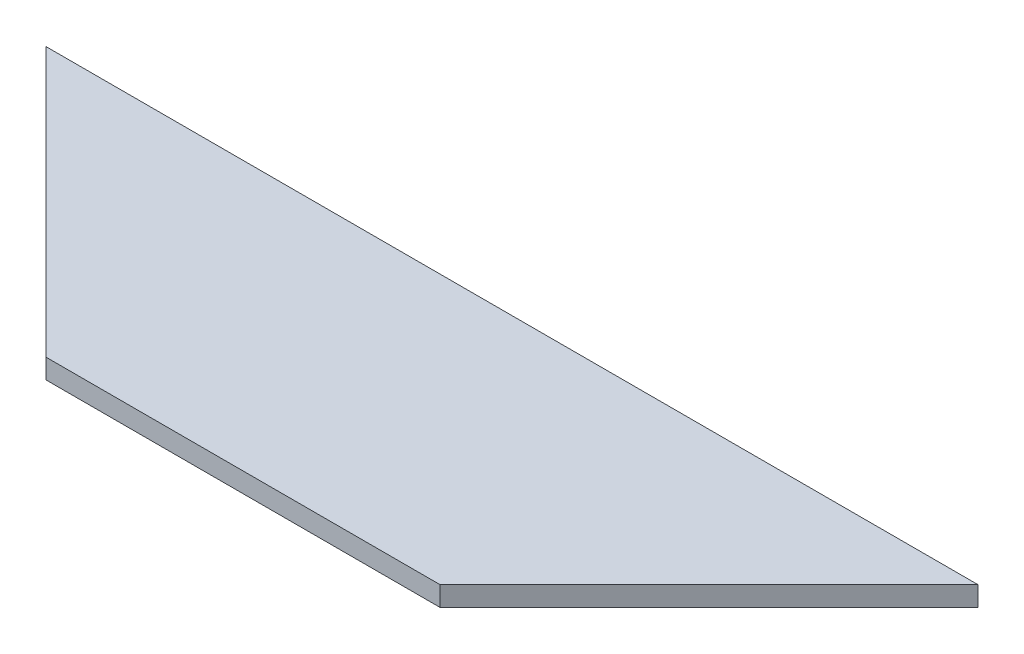
ISO-10303-21;
HEADER;
FILE_DESCRIPTION(('STEP AP214'),'2;1');
FILE_NAME('part.step','',(''),(''),'','','');
FILE_SCHEMA(('AUTOMOTIVE_DESIGN { 1 0 10303 214 1 1 1 1 }'));
ENDSEC;
DATA;
#1=APPLICATION_CONTEXT('core data for automotive mechanical design processes');
#2=APPLICATION_PROTOCOL_DEFINITION('international standard','automotive_design',2000,#1);
#3=PRODUCT_CONTEXT('',#1,'mechanical');
#4=PRODUCT('Part','Part','',(#3));
#5=PRODUCT_RELATED_PRODUCT_CATEGORY('part','',(#4));
#6=PRODUCT_DEFINITION_FORMATION('','',#4);
#7=PRODUCT_DEFINITION_CONTEXT('part definition',#1,'design');
#8=PRODUCT_DEFINITION('design','',#6,#7);
#9=PRODUCT_DEFINITION_SHAPE('','',#8);
#10=(LENGTH_UNIT() NAMED_UNIT(*) SI_UNIT(.MILLI.,.METRE.));
#11=(NAMED_UNIT(*) PLANE_ANGLE_UNIT() SI_UNIT($,.RADIAN.));
#12=(NAMED_UNIT(*) SI_UNIT($,.STERADIAN.) SOLID_ANGLE_UNIT());
#13=UNCERTAINTY_MEASURE_WITH_UNIT(LENGTH_MEASURE(1.E-05),#10,'distance_accuracy_value','');
#14=(GEOMETRIC_REPRESENTATION_CONTEXT(3) GLOBAL_UNCERTAINTY_ASSIGNED_CONTEXT((#13)) GLOBAL_UNIT_ASSIGNED_CONTEXT((#10,
#11,#12)) REPRESENTATION_CONTEXT('',''));
#15=CARTESIAN_POINT('',(0.,0.,0.));
#16=DIRECTION('',(0.,0.,1.));
#17=DIRECTION('',(1.,0.,0.));
#18=AXIS2_PLACEMENT_3D('',#15,#16,#17);
#19=CARTESIAN_POINT('',(259.737032749589,19.05,259.737032749575));
#20=DIRECTION('',(0.707106781186528,0.,-0.707106781186567));
#21=DIRECTION('',(-0.707106781186567,0.,-0.707106781186528));
#22=AXIS2_PLACEMENT_3D('',#19,#20,#21);
#23=PLANE('',#22);
#24=DIRECTION('',(0.707106781186567,0.,0.707106781186528));
#25=VECTOR('',#24,1.);
#26=CARTESIAN_POINT('',(259.737032749589,0.,259.737032749575));
#27=LINE('',#26,#25);
#28=CARTESIAN_POINT('',(0.,0.,0.));
#29=VERTEX_POINT('',#28);
#30=CARTESIAN_POINT('',(259.737032749589,0.,259.737032749575));
#31=VERTEX_POINT('',#30);
#32=EDGE_CURVE('E102',#29,#31,#27,.T.);
#33=ORIENTED_EDGE('',*,*,#32,.T.);
#34=DIRECTION('',(0.,-1.,0.));
#35=VECTOR('',#34,1.);
#36=CARTESIAN_POINT('',(259.737032749589,19.05,259.737032749575));
#37=LINE('',#36,#35);
#38=CARTESIAN_POINT('',(259.737032749589,19.05,259.737032749575));
#39=VERTEX_POINT('',#38);
#40=EDGE_CURVE('E11',#39,#31,#37,.T.);
#41=ORIENTED_EDGE('',*,*,#40,.F.);
#42=DIRECTION('',(0.707106781186567,0.,0.707106781186528));
#43=VECTOR('',#42,1.);
#44=CARTESIAN_POINT('',(259.737032749589,19.05,259.737032749575));
#45=LINE('',#44,#43);
#46=CARTESIAN_POINT('',(0.,19.05,0.));
#47=VERTEX_POINT('',#46);
#48=EDGE_CURVE('E90',#47,#39,#45,.T.);
#49=ORIENTED_EDGE('',*,*,#48,.F.);
#50=DIRECTION('',(0.,-1.,0.));
#51=VECTOR('',#50,1.);
#52=CARTESIAN_POINT('',(0.,19.05,0.));
#53=LINE('',#52,#51);
#54=EDGE_CURVE('E98',#47,#29,#53,.T.);
#55=ORIENTED_EDGE('',*,*,#54,.T.);
#56=EDGE_LOOP('',(#33,#41,#49,#55));
#57=FACE_BOUND('',#56,.T.);
#58=ADVANCED_FACE('F39',(#57),#23,.F.);
#59=CARTESIAN_POINT('',(640.262967250417,19.05,259.737032749581));
#60=DIRECTION('',(0.,0.,-1.));
#61=DIRECTION('',(-1.,0.,0.));
#62=AXIS2_PLACEMENT_3D('',#59,#60,#61);
#63=PLANE('',#62);
#64=DIRECTION('',(1.,0.,0.));
#65=VECTOR('',#64,1.);
#66=CARTESIAN_POINT('',(640.262967250417,0.,259.737032749581));
#67=LINE('',#66,#65);
#68=CARTESIAN_POINT('',(640.262967250417,0.,259.737032749581));
#69=VERTEX_POINT('',#68);
#70=EDGE_CURVE('E94',#31,#69,#67,.T.);
#71=ORIENTED_EDGE('',*,*,#70,.T.);
#72=DIRECTION('',(0.,-1.,0.));
#73=VECTOR('',#72,1.);
#74=CARTESIAN_POINT('',(640.262967250417,19.05,259.737032749581));
#75=LINE('',#74,#73);
#76=CARTESIAN_POINT('',(640.262967250417,19.05,259.737032749581));
#77=VERTEX_POINT('',#76);
#78=EDGE_CURVE('E47',#77,#69,#75,.T.);
#79=ORIENTED_EDGE('',*,*,#78,.F.);
#80=DIRECTION('',(1.,0.,0.));
#81=VECTOR('',#80,1.);
#82=CARTESIAN_POINT('',(640.262967250417,19.05,259.737032749581));
#83=LINE('',#82,#81);
#84=EDGE_CURVE('E85',#39,#77,#83,.T.);
#85=ORIENTED_EDGE('',*,*,#84,.F.);
#86=ORIENTED_EDGE('',*,*,#40,.T.);
#87=EDGE_LOOP('',(#71,#79,#85,#86));
#88=FACE_BOUND('',#87,.T.);
#89=ADVANCED_FACE('F93',(#88),#63,.F.);
#90=CARTESIAN_POINT('',(900.,19.05,0.));
#91=DIRECTION('',(-0.707106781186544,0.,-0.707106781186551));
#92=DIRECTION('',(-0.707106781186551,0.,0.707106781186544));
#93=AXIS2_PLACEMENT_3D('',#90,#91,#92);
#94=PLANE('',#93);
#95=DIRECTION('',(0.707106781186551,0.,-0.707106781186544));
#96=VECTOR('',#95,1.);
#97=CARTESIAN_POINT('',(900.,0.,0.));
#98=LINE('',#97,#96);
#99=CARTESIAN_POINT('',(900.,0.,0.));
#100=VERTEX_POINT('',#99);
#101=EDGE_CURVE('E72',#69,#100,#98,.T.);
#102=ORIENTED_EDGE('',*,*,#101,.T.);
#103=DIRECTION('',(0.,-1.,0.));
#104=VECTOR('',#103,1.);
#105=CARTESIAN_POINT('',(900.,19.05,0.));
#106=LINE('',#105,#104);
#107=CARTESIAN_POINT('',(900.,19.05,0.));
#108=VERTEX_POINT('',#107);
#109=EDGE_CURVE('E95',#108,#100,#106,.T.);
#110=ORIENTED_EDGE('',*,*,#109,.F.);
#111=DIRECTION('',(0.707106781186551,0.,-0.707106781186544));
#112=VECTOR('',#111,1.);
#113=CARTESIAN_POINT('',(900.,19.05,0.));
#114=LINE('',#113,#112);
#115=EDGE_CURVE('E88',#77,#108,#114,.T.);
#116=ORIENTED_EDGE('',*,*,#115,.F.);
#117=ORIENTED_EDGE('',*,*,#78,.T.);
#118=EDGE_LOOP('',(#102,#110,#116,#117));
#119=FACE_BOUND('',#118,.T.);
#120=ADVANCED_FACE('F96',(#119),#94,.F.);
#121=CARTESIAN_POINT('',(0.,19.05,0.));
#122=DIRECTION('',(0.,0.,1.));
#123=DIRECTION('',(1.,0.,0.));
#124=AXIS2_PLACEMENT_3D('',#121,#122,#123);
#125=PLANE('',#124);
#126=DIRECTION('',(-1.,0.,0.));
#127=VECTOR('',#126,1.);
#128=CARTESIAN_POINT('',(0.,0.,0.));
#129=LINE('',#128,#127);
#130=EDGE_CURVE('E78',#100,#29,#129,.T.);
#131=ORIENTED_EDGE('',*,*,#130,.T.);
#132=ORIENTED_EDGE('',*,*,#54,.F.);
#133=DIRECTION('',(-1.,0.,0.));
#134=VECTOR('',#133,1.);
#135=CARTESIAN_POINT('',(0.,19.05,0.));
#136=LINE('',#135,#134);
#137=EDGE_CURVE('E55',#108,#47,#136,.T.);
#138=ORIENTED_EDGE('',*,*,#137,.F.);
#139=ORIENTED_EDGE('',*,*,#109,.T.);
#140=EDGE_LOOP('',(#131,#132,#138,#139));
#141=FACE_BOUND('',#140,.T.);
#142=ADVANCED_FACE('F109',(#141),#125,.F.);
#143=CARTESIAN_POINT('',(0.,19.05,0.));
#144=DIRECTION('',(0.,1.,0.));
#145=DIRECTION('',(0.,0.,1.));
#146=AXIS2_PLACEMENT_3D('',#143,#144,#145);
#147=PLANE('',#146);
#148=ORIENTED_EDGE('',*,*,#48,.T.);
#149=ORIENTED_EDGE('',*,*,#84,.T.);
#150=ORIENTED_EDGE('',*,*,#115,.T.);
#151=ORIENTED_EDGE('',*,*,#137,.T.);
#152=EDGE_LOOP('',(#148,#149,#150,#151));
#153=FACE_BOUND('',#152,.T.);
#154=ADVANCED_FACE('F86',(#153),#147,.T.);
#155=CARTESIAN_POINT('',(0.,0.,0.));
#156=DIRECTION('',(0.,1.,0.));
#157=DIRECTION('',(0.,0.,1.));
#158=AXIS2_PLACEMENT_3D('',#155,#156,#157);
#159=PLANE('',#158);
#160=ORIENTED_EDGE('',*,*,#32,.F.);
#161=ORIENTED_EDGE('',*,*,#130,.F.);
#162=ORIENTED_EDGE('',*,*,#101,.F.);
#163=ORIENTED_EDGE('',*,*,#70,.F.);
#164=EDGE_LOOP('',(#160,#161,#162,#163));
#165=FACE_BOUND('',#164,.T.);
#166=ADVANCED_FACE('F112',(#165),#159,.F.);
#167=CLOSED_SHELL('',(#58,#89,#120,#142,#154,#166));
#168=MANIFOLD_SOLID_BREP('B2',#167);
#169=ADVANCED_BREP_SHAPE_REPRESENTATION('',(#18,#168),#14);
#170=SHAPE_DEFINITION_REPRESENTATION(#9,#169);
ENDSEC;
END-ISO-10303-21;
